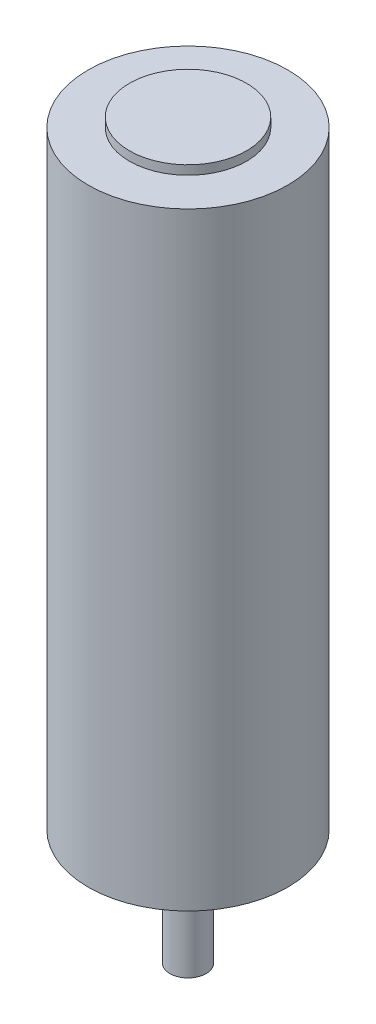
ISO-10303-21;
HEADER;
FILE_DESCRIPTION(('STEP AP214'),'2;1');
FILE_NAME('part.step','',(''),(''),'','','');
FILE_SCHEMA(('AUTOMOTIVE_DESIGN { 1 0 10303 214 1 1 1 1 }'));
ENDSEC;
DATA;
#1=APPLICATION_CONTEXT('core data for automotive mechanical design processes');
#2=APPLICATION_PROTOCOL_DEFINITION('international standard','automotive_design',2000,#1);
#3=PRODUCT_CONTEXT('',#1,'mechanical');
#4=PRODUCT('Part','Part','',(#3));
#5=PRODUCT_RELATED_PRODUCT_CATEGORY('part','',(#4));
#6=PRODUCT_DEFINITION_FORMATION('','',#4);
#7=PRODUCT_DEFINITION_CONTEXT('part definition',#1,'design');
#8=PRODUCT_DEFINITION('design','',#6,#7);
#9=PRODUCT_DEFINITION_SHAPE('','',#8);
#10=(LENGTH_UNIT() NAMED_UNIT(*) SI_UNIT(.MILLI.,.METRE.));
#11=(NAMED_UNIT(*) PLANE_ANGLE_UNIT() SI_UNIT($,.RADIAN.));
#12=(NAMED_UNIT(*) SI_UNIT($,.STERADIAN.) SOLID_ANGLE_UNIT());
#13=UNCERTAINTY_MEASURE_WITH_UNIT(LENGTH_MEASURE(1.E-05),#10,'distance_accuracy_value','');
#14=(GEOMETRIC_REPRESENTATION_CONTEXT(3) GLOBAL_UNCERTAINTY_ASSIGNED_CONTEXT((#13)) GLOBAL_UNIT_ASSIGNED_CONTEXT((#10,
#11,#12)) REPRESENTATION_CONTEXT('',''));
#15=CARTESIAN_POINT('',(0.,0.,0.));
#16=DIRECTION('',(0.,0.,1.));
#17=DIRECTION('',(1.,0.,0.));
#18=AXIS2_PLACEMENT_3D('',#15,#16,#17);
#19=CARTESIAN_POINT('',(0.,33.5,0.));
#20=DIRECTION('',(0.,-1.,0.));
#21=DIRECTION('',(0.,0.,-1.));
#22=AXIS2_PLACEMENT_3D('',#19,#20,#21);
#23=CYLINDRICAL_SURFACE('',#22,11.);
#24=CARTESIAN_POINT('',(0.,33.5,0.));
#25=DIRECTION('',(0.,1.,0.));
#26=DIRECTION('',(0.,0.,1.));
#27=AXIS2_PLACEMENT_3D('',#24,#25,#26);
#28=CIRCLE('',#27,11.);
#29=CARTESIAN_POINT('',(0.,33.5,11.));
#30=VERTEX_POINT('',#29);
#31=EDGE_CURVE('E123',#30,#30,#28,.T.);
#32=ORIENTED_EDGE('',*,*,#31,.F.);
#33=EDGE_LOOP('',(#32));
#34=FACE_BOUND('',#33,.T.);
#35=CARTESIAN_POINT('',(0.,-33.5,0.));
#36=DIRECTION('',(0.,1.,0.));
#37=DIRECTION('',(0.,0.,1.));
#38=AXIS2_PLACEMENT_3D('',#35,#36,#37);
#39=CIRCLE('',#38,11.);
#40=CARTESIAN_POINT('',(0.,-33.5,11.));
#41=VERTEX_POINT('',#40);
#42=EDGE_CURVE('E47',#41,#41,#39,.T.);
#43=ORIENTED_EDGE('',*,*,#42,.T.);
#44=EDGE_LOOP('',(#43));
#45=FACE_BOUND('',#44,.T.);
#46=ADVANCED_FACE('F44',(#34,#45),#23,.T.);
#47=CARTESIAN_POINT('',(0.,33.5,0.));
#48=DIRECTION('',(0.,1.,0.));
#49=DIRECTION('',(0.,0.,1.));
#50=AXIS2_PLACEMENT_3D('',#47,#48,#49);
#51=PLANE('',#50);
#52=CARTESIAN_POINT('',(0.,33.5,0.));
#53=DIRECTION('',(0.,1.,0.));
#54=DIRECTION('',(0.,0.,1.));
#55=AXIS2_PLACEMENT_3D('',#52,#53,#54);
#56=CIRCLE('',#55,6.45);
#57=CARTESIAN_POINT('',(0.,33.5,6.45));
#58=VERTEX_POINT('',#57);
#59=EDGE_CURVE('E117',#58,#58,#56,.T.);
#60=ORIENTED_EDGE('',*,*,#59,.F.);
#61=EDGE_LOOP('',(#60));
#62=FACE_BOUND('',#61,.T.);
#63=ORIENTED_EDGE('',*,*,#31,.T.);
#64=EDGE_LOOP('',(#63));
#65=FACE_BOUND('',#64,.T.);
#66=ADVANCED_FACE('F136',(#62,#65),#51,.T.);
#67=CARTESIAN_POINT('',(0.,-33.5,0.));
#68=DIRECTION('',(0.,1.,0.));
#69=DIRECTION('',(0.,0.,1.));
#70=AXIS2_PLACEMENT_3D('',#67,#68,#69);
#71=PLANE('',#70);
#72=CARTESIAN_POINT('',(7.25,-33.5,-4.18563164289453));
#73=DIRECTION('',(0.,-1.,0.));
#74=DIRECTION('',(0.,0.,-1.));
#75=AXIS2_PLACEMENT_3D('',#72,#73,#74);
#76=CIRCLE('',#75,1.24999999999999);
#77=CARTESIAN_POINT('',(7.25,-33.5,-5.43563164289452));
#78=VERTEX_POINT('',#77);
#79=EDGE_CURVE('E76',#78,#78,#76,.T.);
#80=ORIENTED_EDGE('',*,*,#79,.F.);
#81=EDGE_LOOP('',(#80));
#82=FACE_BOUND('',#81,.T.);
#83=CARTESIAN_POINT('',(-7.25,-33.5,-4.18563164289453));
#84=DIRECTION('',(0.,-1.,0.));
#85=DIRECTION('',(0.,0.,-1.));
#86=AXIS2_PLACEMENT_3D('',#83,#84,#85);
#87=CIRCLE('',#86,1.24999999999999);
#88=CARTESIAN_POINT('',(-7.25,-33.5,-5.43563164289452));
#89=VERTEX_POINT('',#88);
#90=EDGE_CURVE('E75',#89,#89,#87,.T.);
#91=ORIENTED_EDGE('',*,*,#90,.F.);
#92=EDGE_LOOP('',(#91));
#93=FACE_BOUND('',#92,.T.);
#94=CARTESIAN_POINT('',(0.,-33.5,8.37173671197983));
#95=DIRECTION('',(0.,-1.,0.));
#96=DIRECTION('',(0.,0.,-1.));
#97=AXIS2_PLACEMENT_3D('',#94,#95,#96);
#98=CIRCLE('',#97,1.24999999999999);
#99=CARTESIAN_POINT('',(0.,-33.5,7.12173671197984));
#100=VERTEX_POINT('',#99);
#101=EDGE_CURVE('E89',#100,#100,#98,.T.);
#102=ORIENTED_EDGE('',*,*,#101,.F.);
#103=EDGE_LOOP('',(#102));
#104=FACE_BOUND('',#103,.T.);
#105=CARTESIAN_POINT('',(0.,-33.5,0.));
#106=DIRECTION('',(0.,-1.,0.));
#107=DIRECTION('',(0.,0.,-1.));
#108=AXIS2_PLACEMENT_3D('',#105,#106,#107);
#109=CIRCLE('',#108,6.);
#110=CARTESIAN_POINT('',(0.,-33.5,-6.));
#111=VERTEX_POINT('',#110);
#112=EDGE_CURVE('E109',#111,#111,#109,.T.);
#113=ORIENTED_EDGE('',*,*,#112,.F.);
#114=EDGE_LOOP('',(#113));
#115=FACE_BOUND('',#114,.T.);
#116=ORIENTED_EDGE('',*,*,#42,.F.);
#117=EDGE_LOOP('',(#116));
#118=FACE_BOUND('',#117,.T.);
#119=ADVANCED_FACE('F133',(#82,#93,#104,#115,#118),#71,.F.);
#120=CARTESIAN_POINT('',(0.,34.5,0.));
#121=DIRECTION('',(0.,-1.,0.));
#122=DIRECTION('',(0.,0.,-1.));
#123=AXIS2_PLACEMENT_3D('',#120,#121,#122);
#124=CYLINDRICAL_SURFACE('',#123,6.45);
#125=CARTESIAN_POINT('',(0.,34.5,0.));
#126=DIRECTION('',(0.,1.,0.));
#127=DIRECTION('',(0.,0.,1.));
#128=AXIS2_PLACEMENT_3D('',#125,#126,#127);
#129=CIRCLE('',#128,6.45);
#130=CARTESIAN_POINT('',(0.,34.5,6.45));
#131=VERTEX_POINT('',#130);
#132=EDGE_CURVE('E113',#131,#131,#129,.T.);
#133=ORIENTED_EDGE('',*,*,#132,.F.);
#134=EDGE_LOOP('',(#133));
#135=FACE_BOUND('',#134,.T.);
#136=ORIENTED_EDGE('',*,*,#59,.T.);
#137=EDGE_LOOP('',(#136));
#138=FACE_BOUND('',#137,.T.);
#139=ADVANCED_FACE('F135',(#135,#138),#124,.T.);
#140=CARTESIAN_POINT('',(0.,34.5,0.));
#141=DIRECTION('',(0.,1.,0.));
#142=DIRECTION('',(0.,0.,1.));
#143=AXIS2_PLACEMENT_3D('',#140,#141,#142);
#144=PLANE('',#143);
#145=ORIENTED_EDGE('',*,*,#132,.T.);
#146=EDGE_LOOP('',(#145));
#147=FACE_BOUND('',#146,.T.);
#148=ADVANCED_FACE('F143',(#147),#144,.T.);
#149=CARTESIAN_POINT('',(0.,-34.5,0.));
#150=DIRECTION('',(0.,1.,0.));
#151=DIRECTION('',(0.,0.,1.));
#152=AXIS2_PLACEMENT_3D('',#149,#150,#151);
#153=CYLINDRICAL_SURFACE('',#152,6.);
#154=CARTESIAN_POINT('',(0.,-34.5,0.));
#155=DIRECTION('',(0.,-1.,0.));
#156=DIRECTION('',(0.,0.,-1.));
#157=AXIS2_PLACEMENT_3D('',#154,#155,#156);
#158=CIRCLE('',#157,6.);
#159=CARTESIAN_POINT('',(0.,-34.5,-6.));
#160=VERTEX_POINT('',#159);
#161=EDGE_CURVE('E105',#160,#160,#158,.T.);
#162=ORIENTED_EDGE('',*,*,#161,.F.);
#163=EDGE_LOOP('',(#162));
#164=FACE_BOUND('',#163,.T.);
#165=ORIENTED_EDGE('',*,*,#112,.T.);
#166=EDGE_LOOP('',(#165));
#167=FACE_BOUND('',#166,.T.);
#168=ADVANCED_FACE('F172',(#164,#167),#153,.T.);
#169=CARTESIAN_POINT('',(0.,-34.5,0.));
#170=DIRECTION('',(0.,-1.,0.));
#171=DIRECTION('',(0.,0.,-1.));
#172=AXIS2_PLACEMENT_3D('',#169,#170,#171);
#173=PLANE('',#172);
#174=CARTESIAN_POINT('',(0.,-34.5,0.));
#175=DIRECTION('',(0.,-1.,0.));
#176=DIRECTION('',(0.,0.,-1.));
#177=AXIS2_PLACEMENT_3D('',#174,#175,#176);
#178=CIRCLE('',#177,3.25);
#179=CARTESIAN_POINT('',(0.,-34.5,-3.25));
#180=VERTEX_POINT('',#179);
#181=EDGE_CURVE('E53',#180,#180,#178,.T.);
#182=ORIENTED_EDGE('',*,*,#181,.F.);
#183=EDGE_LOOP('',(#182));
#184=FACE_BOUND('',#183,.T.);
#185=ORIENTED_EDGE('',*,*,#161,.T.);
#186=EDGE_LOOP('',(#185));
#187=FACE_BOUND('',#186,.T.);
#188=ADVANCED_FACE('F181',(#184,#187),#173,.T.);
#189=CARTESIAN_POINT('',(0.,-36.,0.));
#190=DIRECTION('',(0.,1.,0.));
#191=DIRECTION('',(0.,0.,1.));
#192=AXIS2_PLACEMENT_3D('',#189,#190,#191);
#193=CYLINDRICAL_SURFACE('',#192,3.25);
#194=CARTESIAN_POINT('',(0.,-36.,0.));
#195=DIRECTION('',(0.,-1.,0.));
#196=DIRECTION('',(0.,0.,-1.));
#197=AXIS2_PLACEMENT_3D('',#194,#195,#196);
#198=CIRCLE('',#197,3.25);
#199=CARTESIAN_POINT('',(0.,-36.,-3.25));
#200=VERTEX_POINT('',#199);
#201=EDGE_CURVE('E100',#200,#200,#198,.T.);
#202=ORIENTED_EDGE('',*,*,#201,.F.);
#203=EDGE_LOOP('',(#202));
#204=FACE_BOUND('',#203,.T.);
#205=ORIENTED_EDGE('',*,*,#181,.T.);
#206=EDGE_LOOP('',(#205));
#207=FACE_BOUND('',#206,.T.);
#208=ADVANCED_FACE('F190',(#204,#207),#193,.T.);
#209=CARTESIAN_POINT('',(0.,-36.,0.));
#210=DIRECTION('',(0.,-1.,0.));
#211=DIRECTION('',(0.,0.,-1.));
#212=AXIS2_PLACEMENT_3D('',#209,#210,#211);
#213=PLANE('',#212);
#214=CARTESIAN_POINT('',(0.,-36.,0.));
#215=DIRECTION('',(0.,-1.,0.));
#216=DIRECTION('',(0.,0.,-1.));
#217=AXIS2_PLACEMENT_3D('',#214,#215,#216);
#218=CIRCLE('',#217,2.);
#219=CARTESIAN_POINT('',(0.,-36.,-2.));
#220=VERTEX_POINT('',#219);
#221=EDGE_CURVE('E11',#220,#220,#218,.T.);
#222=ORIENTED_EDGE('',*,*,#221,.F.);
#223=EDGE_LOOP('',(#222));
#224=FACE_BOUND('',#223,.T.);
#225=ORIENTED_EDGE('',*,*,#201,.T.);
#226=EDGE_LOOP('',(#225));
#227=FACE_BOUND('',#226,.T.);
#228=ADVANCED_FACE('F199',(#224,#227),#213,.T.);
#229=CARTESIAN_POINT('',(0.,-46.25,0.));
#230=DIRECTION('',(0.,1.,0.));
#231=DIRECTION('',(0.,0.,1.));
#232=AXIS2_PLACEMENT_3D('',#229,#230,#231);
#233=CYLINDRICAL_SURFACE('',#232,2.);
#234=CARTESIAN_POINT('',(0.,-46.25,0.));
#235=DIRECTION('',(0.,-1.,0.));
#236=DIRECTION('',(0.,0.,-1.));
#237=AXIS2_PLACEMENT_3D('',#234,#235,#236);
#238=CIRCLE('',#237,2.);
#239=CARTESIAN_POINT('',(0.,-46.25,-2.));
#240=VERTEX_POINT('',#239);
#241=EDGE_CURVE('E97',#240,#240,#238,.T.);
#242=ORIENTED_EDGE('',*,*,#241,.F.);
#243=EDGE_LOOP('',(#242));
#244=FACE_BOUND('',#243,.T.);
#245=ORIENTED_EDGE('',*,*,#221,.T.);
#246=EDGE_LOOP('',(#245));
#247=FACE_BOUND('',#246,.T.);
#248=ADVANCED_FACE('F208',(#244,#247),#233,.T.);
#249=CARTESIAN_POINT('',(0.,-46.25,0.));
#250=DIRECTION('',(0.,-1.,0.));
#251=DIRECTION('',(0.,0.,-1.));
#252=AXIS2_PLACEMENT_3D('',#249,#250,#251);
#253=PLANE('',#252);
#254=ORIENTED_EDGE('',*,*,#241,.T.);
#255=EDGE_LOOP('',(#254));
#256=FACE_BOUND('',#255,.T.);
#257=ADVANCED_FACE('F216',(#256),#253,.T.);
#258=CARTESIAN_POINT('',(0.,-26.5,8.37173671197983));
#259=DIRECTION('',(0.,-1.,0.));
#260=DIRECTION('',(0.,0.,-1.));
#261=AXIS2_PLACEMENT_3D('',#258,#259,#260);
#262=CONICAL_SURFACE('',#261,1.25,1.02974425867665);
#263=CARTESIAN_POINT('',(0.,-25.7489242262155,8.37173671197983));
#264=VERTEX_POINT('',#263);
#265=VERTEX_LOOP('',#264);
#266=FACE_BOUND('',#265,.T.);
#267=CARTESIAN_POINT('',(0.,-26.5,8.37173671197983));
#268=DIRECTION('',(0.,-1.,0.));
#269=DIRECTION('',(0.,0.,-1.));
#270=AXIS2_PLACEMENT_3D('',#267,#268,#269);
#271=CIRCLE('',#270,1.25);
#272=CARTESIAN_POINT('',(0.,-26.5,7.12173671197983));
#273=VERTEX_POINT('',#272);
#274=EDGE_CURVE('E93',#273,#273,#271,.T.);
#275=ORIENTED_EDGE('',*,*,#274,.T.);
#276=EDGE_LOOP('',(#275));
#277=FACE_BOUND('',#276,.T.);
#278=ADVANCED_FACE('F224',(#266,#277),#262,.F.);
#279=CARTESIAN_POINT('',(0.,-33.5,8.37173671197983));
#280=DIRECTION('',(0.,-1.,0.));
#281=DIRECTION('',(0.,0.,-1.));
#282=AXIS2_PLACEMENT_3D('',#279,#280,#281);
#283=CYLINDRICAL_SURFACE('',#282,1.24999999999999);
#284=ORIENTED_EDGE('',*,*,#274,.F.);
#285=EDGE_LOOP('',(#284));
#286=FACE_BOUND('',#285,.T.);
#287=ORIENTED_EDGE('',*,*,#101,.T.);
#288=EDGE_LOOP('',(#287));
#289=FACE_BOUND('',#288,.T.);
#290=ADVANCED_FACE('F236',(#286,#289),#283,.F.);
#291=CARTESIAN_POINT('',(-7.25,-26.5,-4.18563164289453));
#292=DIRECTION('',(0.,-1.,0.));
#293=DIRECTION('',(0.,0.,-1.));
#294=AXIS2_PLACEMENT_3D('',#291,#292,#293);
#295=CONICAL_SURFACE('',#294,1.25,1.02974425867665);
#296=CARTESIAN_POINT('',(-7.25,-25.7489242262155,-4.18563164289453));
#297=VERTEX_POINT('',#296);
#298=VERTEX_LOOP('',#297);
#299=FACE_BOUND('',#298,.T.);
#300=CARTESIAN_POINT('',(-7.25,-26.5,-4.18563164289453));
#301=DIRECTION('',(0.,-1.,0.));
#302=DIRECTION('',(0.,0.,-1.));
#303=AXIS2_PLACEMENT_3D('',#300,#301,#302);
#304=CIRCLE('',#303,1.25);
#305=CARTESIAN_POINT('',(-7.25,-26.5,-5.43563164289453));
#306=VERTEX_POINT('',#305);
#307=EDGE_CURVE('E81',#306,#306,#304,.T.);
#308=ORIENTED_EDGE('',*,*,#307,.T.);
#309=EDGE_LOOP('',(#308));
#310=FACE_BOUND('',#309,.T.);
#311=ADVANCED_FACE('F245',(#299,#310),#295,.F.);
#312=CARTESIAN_POINT('',(-7.25,-33.5,-4.18563164289453));
#313=DIRECTION('',(0.,-1.,0.));
#314=DIRECTION('',(0.,0.,-1.));
#315=AXIS2_PLACEMENT_3D('',#312,#313,#314);
#316=CYLINDRICAL_SURFACE('',#315,1.24999999999999);
#317=ORIENTED_EDGE('',*,*,#307,.F.);
#318=EDGE_LOOP('',(#317));
#319=FACE_BOUND('',#318,.T.);
#320=ORIENTED_EDGE('',*,*,#90,.T.);
#321=EDGE_LOOP('',(#320));
#322=FACE_BOUND('',#321,.T.);
#323=ADVANCED_FACE('F68',(#319,#322),#316,.F.);
#324=CARTESIAN_POINT('',(7.25,-26.5,-4.18563164289453));
#325=DIRECTION('',(0.,-1.,0.));
#326=DIRECTION('',(0.,0.,-1.));
#327=AXIS2_PLACEMENT_3D('',#324,#325,#326);
#328=CONICAL_SURFACE('',#327,1.25,1.02974425867665);
#329=CARTESIAN_POINT('',(7.25,-25.7489242262155,-4.18563164289453));
#330=VERTEX_POINT('',#329);
#331=VERTEX_LOOP('',#330);
#332=FACE_BOUND('',#331,.T.);
#333=CARTESIAN_POINT('',(7.25,-26.5,-4.18563164289453));
#334=DIRECTION('',(0.,-1.,0.));
#335=DIRECTION('',(0.,0.,-1.));
#336=AXIS2_PLACEMENT_3D('',#333,#334,#335);
#337=CIRCLE('',#336,1.25);
#338=CARTESIAN_POINT('',(7.25,-26.5,-5.43563164289453));
#339=VERTEX_POINT('',#338);
#340=EDGE_CURVE('E72',#339,#339,#337,.T.);
#341=ORIENTED_EDGE('',*,*,#340,.T.);
#342=EDGE_LOOP('',(#341));
#343=FACE_BOUND('',#342,.T.);
#344=ADVANCED_FACE('F64',(#332,#343),#328,.F.);
#345=CARTESIAN_POINT('',(7.25,-33.5,-4.18563164289453));
#346=DIRECTION('',(0.,-1.,0.));
#347=DIRECTION('',(0.,0.,-1.));
#348=AXIS2_PLACEMENT_3D('',#345,#346,#347);
#349=CYLINDRICAL_SURFACE('',#348,1.24999999999999);
#350=ORIENTED_EDGE('',*,*,#340,.F.);
#351=EDGE_LOOP('',(#350));
#352=FACE_BOUND('',#351,.T.);
#353=ORIENTED_EDGE('',*,*,#79,.T.);
#354=EDGE_LOOP('',(#353));
#355=FACE_BOUND('',#354,.T.);
#356=ADVANCED_FACE('F67',(#352,#355),#349,.F.);
#357=CLOSED_SHELL('',(#46,#66,#119,#139,#148,#168,#188,#208,#228,#248,#257,#278,#290,#311,#323,
#344,#356));
#358=MANIFOLD_SOLID_BREP('B2',#357);
#359=ADVANCED_BREP_SHAPE_REPRESENTATION('',(#18,#358),#14);
#360=SHAPE_DEFINITION_REPRESENTATION(#9,#359);
ENDSEC;
END-ISO-10303-21;
